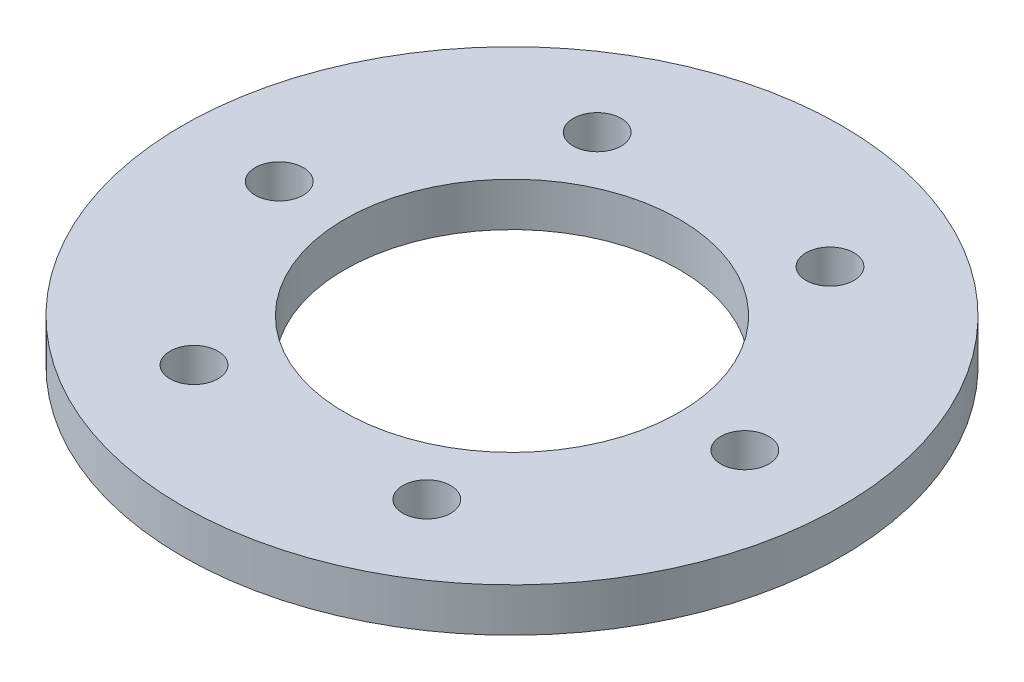
ISO-10303-21;
HEADER;
FILE_DESCRIPTION(('STEP AP214'),'2;1');
FILE_NAME('part.step','',(''),(''),'','','');
FILE_SCHEMA(('AUTOMOTIVE_DESIGN { 1 0 10303 214 1 1 1 1 }'));
ENDSEC;
DATA;
#1=APPLICATION_CONTEXT('core data for automotive mechanical design processes');
#2=APPLICATION_PROTOCOL_DEFINITION('international standard','automotive_design',2000,#1);
#3=PRODUCT_CONTEXT('',#1,'mechanical');
#4=PRODUCT('Part','Part','',(#3));
#5=PRODUCT_RELATED_PRODUCT_CATEGORY('part','',(#4));
#6=PRODUCT_DEFINITION_FORMATION('','',#4);
#7=PRODUCT_DEFINITION_CONTEXT('part definition',#1,'design');
#8=PRODUCT_DEFINITION('design','',#6,#7);
#9=PRODUCT_DEFINITION_SHAPE('','',#8);
#10=(LENGTH_UNIT() NAMED_UNIT(*) SI_UNIT(.MILLI.,.METRE.));
#11=(NAMED_UNIT(*) PLANE_ANGLE_UNIT() SI_UNIT($,.RADIAN.));
#12=(NAMED_UNIT(*) SI_UNIT($,.STERADIAN.) SOLID_ANGLE_UNIT());
#13=UNCERTAINTY_MEASURE_WITH_UNIT(LENGTH_MEASURE(1.E-05),#10,'distance_accuracy_value','');
#14=(GEOMETRIC_REPRESENTATION_CONTEXT(3) GLOBAL_UNCERTAINTY_ASSIGNED_CONTEXT((#13)) GLOBAL_UNIT_ASSIGNED_CONTEXT((#10,
#11,#12)) REPRESENTATION_CONTEXT('',''));
#15=CARTESIAN_POINT('',(0.,0.,0.));
#16=DIRECTION('',(0.,0.,1.));
#17=DIRECTION('',(1.,0.,0.));
#18=AXIS2_PLACEMENT_3D('',#15,#16,#17);
#19=CARTESIAN_POINT('',(-285.501924726853,0.,12.7228753496177));
#20=DIRECTION('',(0.,-1.,0.));
#21=DIRECTION('',(0.,0.,-1.));
#22=AXIS2_PLACEMENT_3D('',#19,#20,#21);
#23=PLANE('',#22);
#24=CARTESIAN_POINT('',(-285.501924726853,0.,12.7228753496177));
#25=DIRECTION('',(0.,-1.,0.));
#26=DIRECTION('',(0.,0.,-1.));
#27=AXIS2_PLACEMENT_3D('',#24,#25,#26);
#28=CIRCLE('',#27,22.65);
#29=CARTESIAN_POINT('',(-285.501924726853,0.,-9.9271246503823));
#30=VERTEX_POINT('',#29);
#31=EDGE_CURVE('E12',#30,#30,#28,.T.);
#32=ORIENTED_EDGE('',*,*,#31,.F.);
#33=EDGE_LOOP('',(#32));
#34=FACE_BOUND('',#33,.T.);
#35=CARTESIAN_POINT('',(-277.501924726853,0.,26.5792818101687));
#36=DIRECTION('',(0.,-1.,0.));
#37=DIRECTION('',(0.,0.,-1.));
#38=AXIS2_PLACEMENT_3D('',#35,#36,#37);
#39=CIRCLE('',#38,1.65);
#40=CARTESIAN_POINT('',(-277.501924726853,0.,24.9292818101687));
#41=VERTEX_POINT('',#40);
#42=EDGE_CURVE('E141',#41,#41,#39,.T.);
#43=ORIENTED_EDGE('',*,*,#42,.T.);
#44=EDGE_LOOP('',(#43));
#45=FACE_BOUND('',#44,.T.);
#46=CARTESIAN_POINT('',(-269.501924726853,0.,12.7228753496177));
#47=DIRECTION('',(0.,-1.,0.));
#48=DIRECTION('',(0.,0.,-1.));
#49=AXIS2_PLACEMENT_3D('',#46,#47,#48);
#50=CIRCLE('',#49,1.65);
#51=CARTESIAN_POINT('',(-269.501924726853,0.,11.0728753496177));
#52=VERTEX_POINT('',#51);
#53=EDGE_CURVE('E108',#52,#52,#50,.T.);
#54=ORIENTED_EDGE('',*,*,#53,.T.);
#55=EDGE_LOOP('',(#54));
#56=FACE_BOUND('',#55,.T.);
#57=CARTESIAN_POINT('',(-277.501924726853,0.,-1.13353111093332));
#58=DIRECTION('',(0.,-1.,0.));
#59=DIRECTION('',(0.,0.,-1.));
#60=AXIS2_PLACEMENT_3D('',#57,#58,#59);
#61=CIRCLE('',#60,1.65);
#62=CARTESIAN_POINT('',(-277.501924726853,0.,-2.78353111093332));
#63=VERTEX_POINT('',#62);
#64=EDGE_CURVE('E23',#63,#63,#61,.T.);
#65=ORIENTED_EDGE('',*,*,#64,.T.);
#66=EDGE_LOOP('',(#65));
#67=FACE_BOUND('',#66,.T.);
#68=CARTESIAN_POINT('',(-293.501924726853,0.,-1.13353111093334));
#69=DIRECTION('',(0.,-1.,0.));
#70=DIRECTION('',(0.,0.,-1.));
#71=AXIS2_PLACEMENT_3D('',#68,#69,#70);
#72=CIRCLE('',#71,1.65);
#73=CARTESIAN_POINT('',(-293.501924726853,0.,-2.78353111093334));
#74=VERTEX_POINT('',#73);
#75=EDGE_CURVE('E137',#74,#74,#72,.T.);
#76=ORIENTED_EDGE('',*,*,#75,.T.);
#77=EDGE_LOOP('',(#76));
#78=FACE_BOUND('',#77,.T.);
#79=CARTESIAN_POINT('',(-301.501924726853,0.,12.7228753496177));
#80=DIRECTION('',(0.,-1.,0.));
#81=DIRECTION('',(0.,0.,-1.));
#82=AXIS2_PLACEMENT_3D('',#79,#80,#81);
#83=CIRCLE('',#82,1.65);
#84=CARTESIAN_POINT('',(-301.501924726853,0.,11.0728753496177));
#85=VERTEX_POINT('',#84);
#86=EDGE_CURVE('E155',#85,#85,#83,.T.);
#87=ORIENTED_EDGE('',*,*,#86,.T.);
#88=EDGE_LOOP('',(#87));
#89=FACE_BOUND('',#88,.T.);
#90=CARTESIAN_POINT('',(-293.501924726853,0.,26.5792818101687));
#91=DIRECTION('',(0.,-1.,0.));
#92=DIRECTION('',(0.,0.,-1.));
#93=AXIS2_PLACEMENT_3D('',#90,#91,#92);
#94=CIRCLE('',#93,1.65);
#95=CARTESIAN_POINT('',(-293.501924726853,0.,24.9292818101687));
#96=VERTEX_POINT('',#95);
#97=EDGE_CURVE('E154',#96,#96,#94,.T.);
#98=ORIENTED_EDGE('',*,*,#97,.T.);
#99=EDGE_LOOP('',(#98));
#100=FACE_BOUND('',#99,.T.);
#101=CARTESIAN_POINT('',(-285.501924726853,0.,12.7228753496177));
#102=DIRECTION('',(0.,-1.,0.));
#103=DIRECTION('',(0.,0.,-1.));
#104=AXIS2_PLACEMENT_3D('',#101,#102,#103);
#105=CIRCLE('',#104,11.5);
#106=CARTESIAN_POINT('',(-285.501924726853,0.,1.2228753496177));
#107=VERTEX_POINT('',#106);
#108=EDGE_CURVE('E173',#107,#107,#105,.T.);
#109=ORIENTED_EDGE('',*,*,#108,.T.);
#110=EDGE_LOOP('',(#109));
#111=FACE_BOUND('',#110,.T.);
#112=ADVANCED_FACE('F19',(#34,#45,#56,#67,#78,#89,#100,#111),#23,.F.);
#113=CARTESIAN_POINT('',(-285.501924726853,-3.,12.7228753496177));
#114=DIRECTION('',(0.,-1.,0.));
#115=DIRECTION('',(0.,0.,-1.));
#116=AXIS2_PLACEMENT_3D('',#113,#114,#115);
#117=PLANE('',#116);
#118=CARTESIAN_POINT('',(-285.501924726853,-3.,12.7228753496177));
#119=DIRECTION('',(0.,-1.,0.));
#120=DIRECTION('',(0.,0.,-1.));
#121=AXIS2_PLACEMENT_3D('',#118,#119,#120);
#122=CIRCLE('',#121,22.65);
#123=CARTESIAN_POINT('',(-285.501924726853,-3.,-9.9271246503823));
#124=VERTEX_POINT('',#123);
#125=EDGE_CURVE('E31',#124,#124,#122,.T.);
#126=ORIENTED_EDGE('',*,*,#125,.T.);
#127=EDGE_LOOP('',(#126));
#128=FACE_BOUND('',#127,.T.);
#129=CARTESIAN_POINT('',(-277.501924726853,-3.,26.5792818101687));
#130=DIRECTION('',(0.,-1.,0.));
#131=DIRECTION('',(0.,0.,-1.));
#132=AXIS2_PLACEMENT_3D('',#129,#130,#131);
#133=CIRCLE('',#132,1.65);
#134=CARTESIAN_POINT('',(-277.501924726853,-3.,24.9292818101687));
#135=VERTEX_POINT('',#134);
#136=EDGE_CURVE('E161',#135,#135,#133,.T.);
#137=ORIENTED_EDGE('',*,*,#136,.F.);
#138=EDGE_LOOP('',(#137));
#139=FACE_BOUND('',#138,.T.);
#140=CARTESIAN_POINT('',(-269.501924726853,-3.,12.7228753496177));
#141=DIRECTION('',(0.,-1.,0.));
#142=DIRECTION('',(0.,0.,-1.));
#143=AXIS2_PLACEMENT_3D('',#140,#141,#142);
#144=CIRCLE('',#143,1.65);
#145=CARTESIAN_POINT('',(-269.501924726853,-3.,11.0728753496177));
#146=VERTEX_POINT('',#145);
#147=EDGE_CURVE('E116',#146,#146,#144,.T.);
#148=ORIENTED_EDGE('',*,*,#147,.F.);
#149=EDGE_LOOP('',(#148));
#150=FACE_BOUND('',#149,.T.);
#151=CARTESIAN_POINT('',(-277.501924726853,-3.,-1.13353111093332));
#152=DIRECTION('',(0.,-1.,0.));
#153=DIRECTION('',(0.,0.,-1.));
#154=AXIS2_PLACEMENT_3D('',#151,#152,#153);
#155=CIRCLE('',#154,1.65);
#156=CARTESIAN_POINT('',(-277.501924726853,-3.,-2.78353111093332));
#157=VERTEX_POINT('',#156);
#158=EDGE_CURVE('E104',#157,#157,#155,.T.);
#159=ORIENTED_EDGE('',*,*,#158,.F.);
#160=EDGE_LOOP('',(#159));
#161=FACE_BOUND('',#160,.T.);
#162=CARTESIAN_POINT('',(-293.501924726853,-3.,-1.13353111093334));
#163=DIRECTION('',(0.,-1.,0.));
#164=DIRECTION('',(0.,0.,-1.));
#165=AXIS2_PLACEMENT_3D('',#162,#163,#164);
#166=CIRCLE('',#165,1.65);
#167=CARTESIAN_POINT('',(-293.501924726853,-3.,-2.78353111093334));
#168=VERTEX_POINT('',#167);
#169=EDGE_CURVE('E114',#168,#168,#166,.T.);
#170=ORIENTED_EDGE('',*,*,#169,.F.);
#171=EDGE_LOOP('',(#170));
#172=FACE_BOUND('',#171,.T.);
#173=CARTESIAN_POINT('',(-301.501924726853,-3.,12.7228753496177));
#174=DIRECTION('',(0.,-1.,0.));
#175=DIRECTION('',(0.,0.,-1.));
#176=AXIS2_PLACEMENT_3D('',#173,#174,#175);
#177=CIRCLE('',#176,1.65);
#178=CARTESIAN_POINT('',(-301.501924726853,-3.,11.0728753496177));
#179=VERTEX_POINT('',#178);
#180=EDGE_CURVE('E122',#179,#179,#177,.T.);
#181=ORIENTED_EDGE('',*,*,#180,.F.);
#182=EDGE_LOOP('',(#181));
#183=FACE_BOUND('',#182,.T.);
#184=CARTESIAN_POINT('',(-293.501924726853,-3.,26.5792818101687));
#185=DIRECTION('',(0.,-1.,0.));
#186=DIRECTION('',(0.,0.,-1.));
#187=AXIS2_PLACEMENT_3D('',#184,#185,#186);
#188=CIRCLE('',#187,1.65);
#189=CARTESIAN_POINT('',(-293.501924726853,-3.,24.9292818101687));
#190=VERTEX_POINT('',#189);
#191=EDGE_CURVE('E149',#190,#190,#188,.T.);
#192=ORIENTED_EDGE('',*,*,#191,.F.);
#193=EDGE_LOOP('',(#192));
#194=FACE_BOUND('',#193,.T.);
#195=CARTESIAN_POINT('',(-285.501924726853,-3.,12.7228753496177));
#196=DIRECTION('',(0.,-1.,0.));
#197=DIRECTION('',(0.,0.,-1.));
#198=AXIS2_PLACEMENT_3D('',#195,#196,#197);
#199=CIRCLE('',#198,11.5);
#200=CARTESIAN_POINT('',(-285.501924726853,-3.,1.2228753496177));
#201=VERTEX_POINT('',#200);
#202=EDGE_CURVE('E138',#201,#201,#199,.T.);
#203=ORIENTED_EDGE('',*,*,#202,.F.);
#204=EDGE_LOOP('',(#203));
#205=FACE_BOUND('',#204,.T.);
#206=ADVANCED_FACE('F213',(#128,#139,#150,#161,#172,#183,#194,#205),#117,.T.);
#207=CARTESIAN_POINT('',(-285.501924726853,-3.,12.7228753496177));
#208=DIRECTION('',(0.,1.,0.));
#209=DIRECTION('',(0.,0.,1.));
#210=AXIS2_PLACEMENT_3D('',#207,#208,#209);
#211=CYLINDRICAL_SURFACE('',#210,22.65);
#212=ORIENTED_EDGE('',*,*,#31,.T.);
#213=EDGE_LOOP('',(#212));
#214=FACE_BOUND('',#213,.T.);
#215=ORIENTED_EDGE('',*,*,#125,.F.);
#216=EDGE_LOOP('',(#215));
#217=FACE_BOUND('',#216,.T.);
#218=ADVANCED_FACE('F216',(#214,#217),#211,.T.);
#219=CARTESIAN_POINT('',(-285.501924726853,-3.,12.7228753496177));
#220=DIRECTION('',(0.,1.,0.));
#221=DIRECTION('',(0.,0.,1.));
#222=AXIS2_PLACEMENT_3D('',#219,#220,#221);
#223=CYLINDRICAL_SURFACE('',#222,11.5);
#224=ORIENTED_EDGE('',*,*,#108,.F.);
#225=EDGE_LOOP('',(#224));
#226=FACE_BOUND('',#225,.T.);
#227=ORIENTED_EDGE('',*,*,#202,.T.);
#228=EDGE_LOOP('',(#227));
#229=FACE_BOUND('',#228,.T.);
#230=ADVANCED_FACE('F249',(#226,#229),#223,.F.);
#231=CARTESIAN_POINT('',(-293.501924726853,-3.,26.5792818101687));
#232=DIRECTION('',(0.,1.,0.));
#233=DIRECTION('',(0.,0.,1.));
#234=AXIS2_PLACEMENT_3D('',#231,#232,#233);
#235=CYLINDRICAL_SURFACE('',#234,1.65);
#236=ORIENTED_EDGE('',*,*,#97,.F.);
#237=EDGE_LOOP('',(#236));
#238=FACE_BOUND('',#237,.T.);
#239=ORIENTED_EDGE('',*,*,#191,.T.);
#240=EDGE_LOOP('',(#239));
#241=FACE_BOUND('',#240,.T.);
#242=ADVANCED_FACE('F244',(#238,#241),#235,.F.);
#243=CARTESIAN_POINT('',(-301.501924726853,-3.,12.7228753496177));
#244=DIRECTION('',(0.,1.,0.));
#245=DIRECTION('',(0.,0.,1.));
#246=AXIS2_PLACEMENT_3D('',#243,#244,#245);
#247=CYLINDRICAL_SURFACE('',#246,1.65);
#248=ORIENTED_EDGE('',*,*,#86,.F.);
#249=EDGE_LOOP('',(#248));
#250=FACE_BOUND('',#249,.T.);
#251=ORIENTED_EDGE('',*,*,#180,.T.);
#252=EDGE_LOOP('',(#251));
#253=FACE_BOUND('',#252,.T.);
#254=ADVANCED_FACE('F21',(#250,#253),#247,.F.);
#255=CARTESIAN_POINT('',(-293.501924726853,-3.,-1.13353111093334));
#256=DIRECTION('',(0.,1.,0.));
#257=DIRECTION('',(0.,0.,1.));
#258=AXIS2_PLACEMENT_3D('',#255,#256,#257);
#259=CYLINDRICAL_SURFACE('',#258,1.65);
#260=ORIENTED_EDGE('',*,*,#75,.F.);
#261=EDGE_LOOP('',(#260));
#262=FACE_BOUND('',#261,.T.);
#263=ORIENTED_EDGE('',*,*,#169,.T.);
#264=EDGE_LOOP('',(#263));
#265=FACE_BOUND('',#264,.T.);
#266=ADVANCED_FACE('F208',(#262,#265),#259,.F.);
#267=CARTESIAN_POINT('',(-277.501924726853,-3.,-1.13353111093332));
#268=DIRECTION('',(0.,1.,0.));
#269=DIRECTION('',(0.,0.,1.));
#270=AXIS2_PLACEMENT_3D('',#267,#268,#269);
#271=CYLINDRICAL_SURFACE('',#270,1.65);
#272=ORIENTED_EDGE('',*,*,#64,.F.);
#273=EDGE_LOOP('',(#272));
#274=FACE_BOUND('',#273,.T.);
#275=ORIENTED_EDGE('',*,*,#158,.T.);
#276=EDGE_LOOP('',(#275));
#277=FACE_BOUND('',#276,.T.);
#278=ADVANCED_FACE('F105',(#274,#277),#271,.F.);
#279=CARTESIAN_POINT('',(-269.501924726853,-3.,12.7228753496177));
#280=DIRECTION('',(0.,1.,0.));
#281=DIRECTION('',(0.,0.,1.));
#282=AXIS2_PLACEMENT_3D('',#279,#280,#281);
#283=CYLINDRICAL_SURFACE('',#282,1.65);
#284=ORIENTED_EDGE('',*,*,#53,.F.);
#285=EDGE_LOOP('',(#284));
#286=FACE_BOUND('',#285,.T.);
#287=ORIENTED_EDGE('',*,*,#147,.T.);
#288=EDGE_LOOP('',(#287));
#289=FACE_BOUND('',#288,.T.);
#290=ADVANCED_FACE('F237',(#286,#289),#283,.F.);
#291=CARTESIAN_POINT('',(-277.501924726853,-3.,26.5792818101687));
#292=DIRECTION('',(0.,1.,0.));
#293=DIRECTION('',(0.,0.,1.));
#294=AXIS2_PLACEMENT_3D('',#291,#292,#293);
#295=CYLINDRICAL_SURFACE('',#294,1.65);
#296=ORIENTED_EDGE('',*,*,#42,.F.);
#297=EDGE_LOOP('',(#296));
#298=FACE_BOUND('',#297,.T.);
#299=ORIENTED_EDGE('',*,*,#136,.T.);
#300=EDGE_LOOP('',(#299));
#301=FACE_BOUND('',#300,.T.);
#302=ADVANCED_FACE('F232',(#298,#301),#295,.F.);
#303=CLOSED_SHELL('',(#112,#206,#218,#230,#242,#254,#266,#278,#290,#302));
#304=MANIFOLD_SOLID_BREP('B1',#303);
#305=ADVANCED_BREP_SHAPE_REPRESENTATION('',(#18,#304),#14);
#306=SHAPE_DEFINITION_REPRESENTATION(#9,#305);
ENDSEC;
END-ISO-10303-21;
